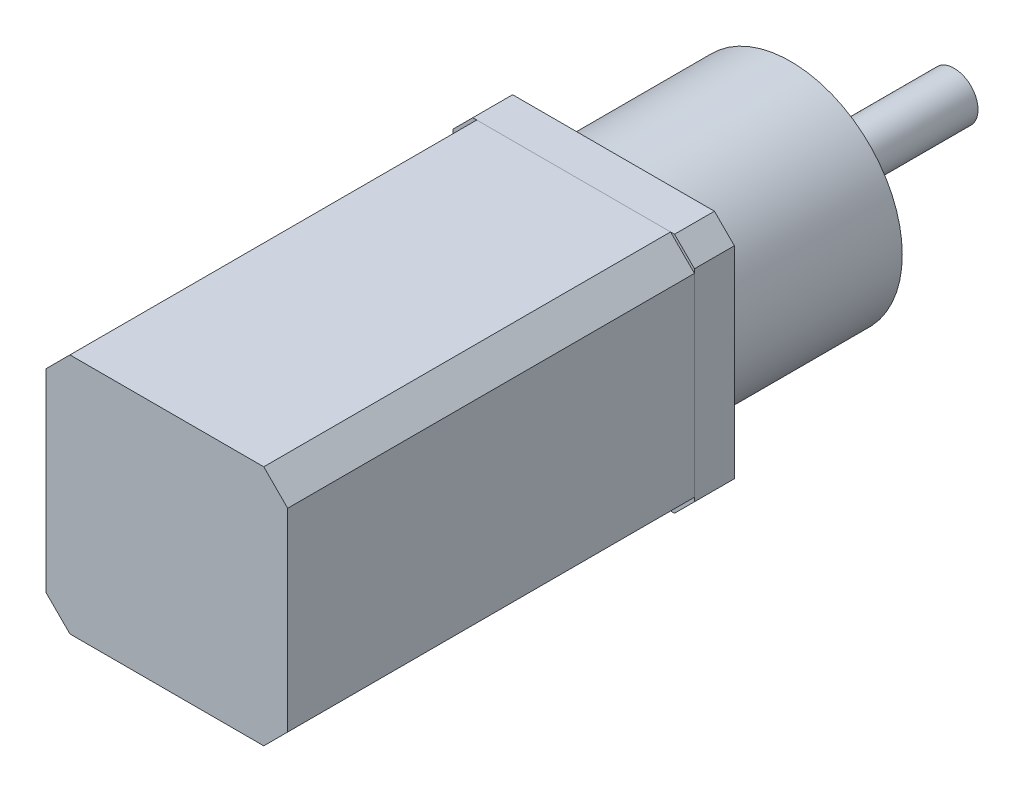
ISO-10303-21;
HEADER;
FILE_DESCRIPTION(('STEP AP214'),'2;1');
FILE_NAME('part.step','',(''),(''),'','','');
FILE_SCHEMA(('AUTOMOTIVE_DESIGN { 1 0 10303 214 1 1 1 1 }'));
ENDSEC;
DATA;
#1=APPLICATION_CONTEXT('core data for automotive mechanical design processes');
#2=APPLICATION_PROTOCOL_DEFINITION('international standard','automotive_design',2000,#1);
#3=PRODUCT_CONTEXT('',#1,'mechanical');
#4=PRODUCT('Part','Part','',(#3));
#5=PRODUCT_RELATED_PRODUCT_CATEGORY('part','',(#4));
#6=PRODUCT_DEFINITION_FORMATION('','',#4);
#7=PRODUCT_DEFINITION_CONTEXT('part definition',#1,'design');
#8=PRODUCT_DEFINITION('design','',#6,#7);
#9=PRODUCT_DEFINITION_SHAPE('','',#8);
#10=(LENGTH_UNIT() NAMED_UNIT(*) SI_UNIT(.MILLI.,.METRE.));
#11=(NAMED_UNIT(*) PLANE_ANGLE_UNIT() SI_UNIT($,.RADIAN.));
#12=(NAMED_UNIT(*) SI_UNIT($,.STERADIAN.) SOLID_ANGLE_UNIT());
#13=UNCERTAINTY_MEASURE_WITH_UNIT(LENGTH_MEASURE(1.E-05),#10,'distance_accuracy_value','');
#14=(GEOMETRIC_REPRESENTATION_CONTEXT(3) GLOBAL_UNCERTAINTY_ASSIGNED_CONTEXT((#13)) GLOBAL_UNIT_ASSIGNED_CONTEXT((#10,
#11,#12)) REPRESENTATION_CONTEXT('',''));
#15=CARTESIAN_POINT('',(0.,0.,0.));
#16=DIRECTION('',(0.,0.,1.));
#17=DIRECTION('',(1.,0.,0.));
#18=AXIS2_PLACEMENT_3D('',#15,#16,#17);
#19=CARTESIAN_POINT('',(-15.15,-15.15,-5.));
#20=DIRECTION('',(1.,0.,0.));
#21=DIRECTION('',(0.,0.,-1.));
#22=AXIS2_PLACEMENT_3D('',#19,#20,#21);
#23=PLANE('',#22);
#24=DIRECTION('',(0.,1.,0.));
#25=VECTOR('',#24,1.);
#26=CARTESIAN_POINT('',(-15.15,-15.15,-5.));
#27=LINE('',#26,#25);
#28=CARTESIAN_POINT('',(-15.15,-12.65,-5.));
#29=VERTEX_POINT('',#28);
#30=CARTESIAN_POINT('',(-15.15,12.65,-5.));
#31=VERTEX_POINT('',#30);
#32=EDGE_CURVE('E141',#29,#31,#27,.T.);
#33=ORIENTED_EDGE('',*,*,#32,.F.);
#34=DIRECTION('',(0.,0.,1.));
#35=VECTOR('',#34,1.);
#36=CARTESIAN_POINT('',(-15.15,-12.65,-5.));
#37=LINE('',#36,#35);
#38=CARTESIAN_POINT('',(-15.15,-12.65,0.));
#39=VERTEX_POINT('',#38);
#40=EDGE_CURVE('E12',#29,#39,#37,.T.);
#41=ORIENTED_EDGE('',*,*,#40,.T.);
#42=DIRECTION('',(0.,1.,0.));
#43=VECTOR('',#42,1.);
#44=CARTESIAN_POINT('',(-15.15,-15.15,0.));
#45=LINE('',#44,#43);
#46=CARTESIAN_POINT('',(-15.15,12.65,0.));
#47=VERTEX_POINT('',#46);
#48=EDGE_CURVE('E143',#39,#47,#45,.T.);
#49=ORIENTED_EDGE('',*,*,#48,.T.);
#50=DIRECTION('',(0.,0.,-1.));
#51=VECTOR('',#50,1.);
#52=CARTESIAN_POINT('',(-15.15,12.65,-5.));
#53=LINE('',#52,#51);
#54=EDGE_CURVE('E54',#47,#31,#53,.T.);
#55=ORIENTED_EDGE('',*,*,#54,.T.);
#56=EDGE_LOOP('',(#33,#41,#49,#55));
#57=FACE_BOUND('',#56,.T.);
#58=ADVANCED_FACE('F46',(#57),#23,.F.);
#59=CARTESIAN_POINT('',(15.15,15.15,-5.));
#60=DIRECTION('',(0.,-1.,0.));
#61=DIRECTION('',(0.,0.,-1.));
#62=AXIS2_PLACEMENT_3D('',#59,#60,#61);
#63=PLANE('',#62);
#64=DIRECTION('',(1.,0.,0.));
#65=VECTOR('',#64,1.);
#66=CARTESIAN_POINT('',(15.15,15.15,0.));
#67=LINE('',#66,#65);
#68=CARTESIAN_POINT('',(-12.65,15.15,0.));
#69=VERTEX_POINT('',#68);
#70=CARTESIAN_POINT('',(12.65,15.15,0.));
#71=VERTEX_POINT('',#70);
#72=EDGE_CURVE('E139',#69,#71,#67,.T.);
#73=ORIENTED_EDGE('',*,*,#72,.T.);
#74=DIRECTION('',(0.,0.,-1.));
#75=VECTOR('',#74,1.);
#76=CARTESIAN_POINT('',(12.65,15.15,-5.));
#77=LINE('',#76,#75);
#78=CARTESIAN_POINT('',(12.65,15.15,-5.));
#79=VERTEX_POINT('',#78);
#80=EDGE_CURVE('E118',#71,#79,#77,.T.);
#81=ORIENTED_EDGE('',*,*,#80,.T.);
#82=DIRECTION('',(1.,0.,0.));
#83=VECTOR('',#82,1.);
#84=CARTESIAN_POINT('',(15.15,15.15,-5.));
#85=LINE('',#84,#83);
#86=CARTESIAN_POINT('',(-12.65,15.15,-5.));
#87=VERTEX_POINT('',#86);
#88=EDGE_CURVE('E187',#87,#79,#85,.T.);
#89=ORIENTED_EDGE('',*,*,#88,.F.);
#90=DIRECTION('',(0.,0.,1.));
#91=VECTOR('',#90,1.);
#92=CARTESIAN_POINT('',(-12.65,15.15,-5.));
#93=LINE('',#92,#91);
#94=EDGE_CURVE('E123',#87,#69,#93,.T.);
#95=ORIENTED_EDGE('',*,*,#94,.T.);
#96=EDGE_LOOP('',(#73,#81,#89,#95));
#97=FACE_BOUND('',#96,.T.);
#98=ADVANCED_FACE('F191',(#97),#63,.F.);
#99=CARTESIAN_POINT('',(15.15,-15.15,-5.));
#100=DIRECTION('',(-1.,0.,0.));
#101=DIRECTION('',(0.,0.,1.));
#102=AXIS2_PLACEMENT_3D('',#99,#100,#101);
#103=PLANE('',#102);
#104=DIRECTION('',(0.,-1.,0.));
#105=VECTOR('',#104,1.);
#106=CARTESIAN_POINT('',(15.15,-15.15,-5.));
#107=LINE('',#106,#105);
#108=CARTESIAN_POINT('',(15.15,12.65,-5.));
#109=VERTEX_POINT('',#108);
#110=CARTESIAN_POINT('',(15.15,-12.65,-5.));
#111=VERTEX_POINT('',#110);
#112=EDGE_CURVE('E132',#109,#111,#107,.T.);
#113=ORIENTED_EDGE('',*,*,#112,.F.);
#114=DIRECTION('',(0.,0.,1.));
#115=VECTOR('',#114,1.);
#116=CARTESIAN_POINT('',(15.15,12.65,-5.));
#117=LINE('',#116,#115);
#118=CARTESIAN_POINT('',(15.15,12.65,0.));
#119=VERTEX_POINT('',#118);
#120=EDGE_CURVE('E117',#109,#119,#117,.T.);
#121=ORIENTED_EDGE('',*,*,#120,.T.);
#122=DIRECTION('',(0.,-1.,0.));
#123=VECTOR('',#122,1.);
#124=CARTESIAN_POINT('',(15.15,-15.15,0.));
#125=LINE('',#124,#123);
#126=CARTESIAN_POINT('',(15.15,-12.65,0.));
#127=VERTEX_POINT('',#126);
#128=EDGE_CURVE('E130',#119,#127,#125,.T.);
#129=ORIENTED_EDGE('',*,*,#128,.T.);
#130=DIRECTION('',(0.,0.,-1.));
#131=VECTOR('',#130,1.);
#132=CARTESIAN_POINT('',(15.15,-12.65,-5.));
#133=LINE('',#132,#131);
#134=EDGE_CURVE('E134',#127,#111,#133,.T.);
#135=ORIENTED_EDGE('',*,*,#134,.T.);
#136=EDGE_LOOP('',(#113,#121,#129,#135));
#137=FACE_BOUND('',#136,.T.);
#138=ADVANCED_FACE('F129',(#137),#103,.F.);
#139=CARTESIAN_POINT('',(15.15,-15.15,-5.));
#140=DIRECTION('',(0.,1.,0.));
#141=DIRECTION('',(0.,0.,1.));
#142=AXIS2_PLACEMENT_3D('',#139,#140,#141);
#143=PLANE('',#142);
#144=DIRECTION('',(-1.,0.,0.));
#145=VECTOR('',#144,1.);
#146=CARTESIAN_POINT('',(15.15,-15.15,-5.));
#147=LINE('',#146,#145);
#148=CARTESIAN_POINT('',(12.65,-15.15,-5.));
#149=VERTEX_POINT('',#148);
#150=CARTESIAN_POINT('',(-12.65,-15.15,-5.));
#151=VERTEX_POINT('',#150);
#152=EDGE_CURVE('E150',#149,#151,#147,.T.);
#153=ORIENTED_EDGE('',*,*,#152,.F.);
#154=DIRECTION('',(0.,0.,1.));
#155=VECTOR('',#154,1.);
#156=CARTESIAN_POINT('',(12.65,-15.15,-5.));
#157=LINE('',#156,#155);
#158=CARTESIAN_POINT('',(12.65,-15.15,0.));
#159=VERTEX_POINT('',#158);
#160=EDGE_CURVE('E172',#149,#159,#157,.T.);
#161=ORIENTED_EDGE('',*,*,#160,.T.);
#162=DIRECTION('',(-1.,0.,0.));
#163=VECTOR('',#162,1.);
#164=CARTESIAN_POINT('',(15.15,-15.15,0.));
#165=LINE('',#164,#163);
#166=CARTESIAN_POINT('',(-12.65,-15.15,0.));
#167=VERTEX_POINT('',#166);
#168=EDGE_CURVE('E138',#159,#167,#165,.T.);
#169=ORIENTED_EDGE('',*,*,#168,.T.);
#170=DIRECTION('',(0.,0.,-1.));
#171=VECTOR('',#170,1.);
#172=CARTESIAN_POINT('',(-12.65,-15.15,-5.));
#173=LINE('',#172,#171);
#174=EDGE_CURVE('E61',#167,#151,#173,.T.);
#175=ORIENTED_EDGE('',*,*,#174,.T.);
#176=EDGE_LOOP('',(#153,#161,#169,#175));
#177=FACE_BOUND('',#176,.T.);
#178=ADVANCED_FACE('F246',(#177),#143,.F.);
#179=CARTESIAN_POINT('',(0.,0.,-5.));
#180=DIRECTION('',(0.,0.,1.));
#181=DIRECTION('',(1.,0.,0.));
#182=AXIS2_PLACEMENT_3D('',#179,#180,#181);
#183=PLANE('',#182);
#184=CARTESIAN_POINT('',(0.,0.,-5.));
#185=DIRECTION('',(0.,0.,1.));
#186=DIRECTION('',(1.,0.,0.));
#187=AXIS2_PLACEMENT_3D('',#184,#185,#186);
#188=CIRCLE('',#187,14.);
#189=CARTESIAN_POINT('',(14.,0.,-5.));
#190=VERTEX_POINT('',#189);
#191=EDGE_CURVE('E147',#190,#190,#188,.F.);
#192=ORIENTED_EDGE('',*,*,#191,.F.);
#193=EDGE_LOOP('',(#192));
#194=FACE_BOUND('',#193,.T.);
#195=ORIENTED_EDGE('',*,*,#88,.T.);
#196=DIRECTION('',(-0.707106781186548,0.707106781186548,0.));
#197=VECTOR('',#196,1.);
#198=CARTESIAN_POINT('',(15.15,12.65,-5.));
#199=LINE('',#198,#197);
#200=EDGE_CURVE('E169',#79,#109,#199,.F.);
#201=ORIENTED_EDGE('',*,*,#200,.T.);
#202=ORIENTED_EDGE('',*,*,#112,.T.);
#203=DIRECTION('',(0.707106781186548,0.707106781186548,0.));
#204=VECTOR('',#203,1.);
#205=CARTESIAN_POINT('',(12.65,-15.15,-5.));
#206=LINE('',#205,#204);
#207=EDGE_CURVE('E68',#111,#149,#206,.F.);
#208=ORIENTED_EDGE('',*,*,#207,.T.);
#209=ORIENTED_EDGE('',*,*,#152,.T.);
#210=DIRECTION('',(0.707106781186548,-0.707106781186548,0.));
#211=VECTOR('',#210,1.);
#212=CARTESIAN_POINT('',(-15.15,-12.65,-5.));
#213=LINE('',#212,#211);
#214=EDGE_CURVE('E166',#151,#29,#213,.F.);
#215=ORIENTED_EDGE('',*,*,#214,.T.);
#216=ORIENTED_EDGE('',*,*,#32,.T.);
#217=DIRECTION('',(-0.707106781186548,-0.707106781186548,0.));
#218=VECTOR('',#217,1.);
#219=CARTESIAN_POINT('',(-12.65,15.15,-5.));
#220=LINE('',#219,#218);
#221=EDGE_CURVE('E164',#31,#87,#220,.F.);
#222=ORIENTED_EDGE('',*,*,#221,.T.);
#223=EDGE_LOOP('',(#195,#201,#202,#208,#209,#215,#216,#222));
#224=FACE_BOUND('',#223,.T.);
#225=ADVANCED_FACE('F184',(#194,#224),#183,.F.);
#226=CARTESIAN_POINT('',(0.,0.,0.));
#227=DIRECTION('',(0.,0.,1.));
#228=DIRECTION('',(1.,0.,0.));
#229=AXIS2_PLACEMENT_3D('',#226,#227,#228);
#230=PLANE('',#229);
#231=ORIENTED_EDGE('',*,*,#128,.F.);
#232=DIRECTION('',(0.707106781186548,-0.707106781186548,0.));
#233=VECTOR('',#232,1.);
#234=CARTESIAN_POINT('',(13.9,13.9,0.));
#235=LINE('',#234,#233);
#236=EDGE_CURVE('E113',#119,#71,#235,.F.);
#237=ORIENTED_EDGE('',*,*,#236,.T.);
#238=ORIENTED_EDGE('',*,*,#72,.F.);
#239=DIRECTION('',(0.707106781186548,0.707106781186548,0.));
#240=VECTOR('',#239,1.);
#241=CARTESIAN_POINT('',(-13.9,13.9,0.));
#242=LINE('',#241,#240);
#243=EDGE_CURVE('E133',#69,#47,#242,.F.);
#244=ORIENTED_EDGE('',*,*,#243,.T.);
#245=ORIENTED_EDGE('',*,*,#48,.F.);
#246=DIRECTION('',(-0.707106781186548,0.707106781186548,0.));
#247=VECTOR('',#246,1.);
#248=CARTESIAN_POINT('',(-13.9,-13.9,0.));
#249=LINE('',#248,#247);
#250=EDGE_CURVE('E158',#39,#167,#249,.F.);
#251=ORIENTED_EDGE('',*,*,#250,.T.);
#252=ORIENTED_EDGE('',*,*,#168,.F.);
#253=DIRECTION('',(-0.707106781186548,-0.707106781186548,0.));
#254=VECTOR('',#253,1.);
#255=CARTESIAN_POINT('',(13.9,-13.9,0.));
#256=LINE('',#255,#254);
#257=EDGE_CURVE('E124',#159,#127,#256,.F.);
#258=ORIENTED_EDGE('',*,*,#257,.T.);
#259=EDGE_LOOP('',(#231,#237,#238,#244,#245,#251,#252,#258));
#260=FACE_BOUND('',#259,.T.);
#261=ADVANCED_FACE('F136',(#260),#230,.T.);
#262=CARTESIAN_POINT('',(0.,0.,-27.2));
#263=DIRECTION('',(0.,0.,1.));
#264=DIRECTION('',(1.,0.,0.));
#265=AXIS2_PLACEMENT_3D('',#262,#263,#264);
#266=CYLINDRICAL_SURFACE('',#265,14.);
#267=CARTESIAN_POINT('',(0.,0.,-27.2));
#268=DIRECTION('',(0.,0.,-1.));
#269=DIRECTION('',(-1.,0.,0.));
#270=AXIS2_PLACEMENT_3D('',#267,#268,#269);
#271=CIRCLE('',#270,14.);
#272=CARTESIAN_POINT('',(-14.,0.,-27.2));
#273=VERTEX_POINT('',#272);
#274=EDGE_CURVE('E192',#273,#273,#271,.T.);
#275=ORIENTED_EDGE('',*,*,#274,.F.);
#276=EDGE_LOOP('',(#275));
#277=FACE_BOUND('',#276,.T.);
#278=ORIENTED_EDGE('',*,*,#191,.T.);
#279=EDGE_LOOP('',(#278));
#280=FACE_BOUND('',#279,.T.);
#281=ADVANCED_FACE('F236',(#277,#280),#266,.T.);
#282=CARTESIAN_POINT('',(0.,0.,-27.2));
#283=DIRECTION('',(0.,0.,-1.));
#284=DIRECTION('',(-1.,0.,0.));
#285=AXIS2_PLACEMENT_3D('',#282,#283,#284);
#286=PLANE('',#285);
#287=CARTESIAN_POINT('',(0.,0.,-27.2));
#288=DIRECTION('',(0.,0.,-1.));
#289=DIRECTION('',(-1.,0.,0.));
#290=AXIS2_PLACEMENT_3D('',#287,#288,#289);
#291=CIRCLE('',#290,9.);
#292=CARTESIAN_POINT('',(-9.,0.,-27.2));
#293=VERTEX_POINT('',#292);
#294=EDGE_CURVE('E200',#293,#293,#291,.T.);
#295=ORIENTED_EDGE('',*,*,#294,.F.);
#296=EDGE_LOOP('',(#295));
#297=FACE_BOUND('',#296,.T.);
#298=ORIENTED_EDGE('',*,*,#274,.T.);
#299=EDGE_LOOP('',(#298));
#300=FACE_BOUND('',#299,.T.);
#301=ADVANCED_FACE('F230',(#297,#300),#286,.T.);
#302=CARTESIAN_POINT('',(0.,0.,-29.2));
#303=DIRECTION('',(0.,0.,1.));
#304=DIRECTION('',(1.,0.,0.));
#305=AXIS2_PLACEMENT_3D('',#302,#303,#304);
#306=CYLINDRICAL_SURFACE('',#305,9.);
#307=CARTESIAN_POINT('',(0.,0.,-29.2));
#308=DIRECTION('',(0.,0.,-1.));
#309=DIRECTION('',(-1.,0.,0.));
#310=AXIS2_PLACEMENT_3D('',#307,#308,#309);
#311=CIRCLE('',#310,9.);
#312=CARTESIAN_POINT('',(-9.,0.,-29.2));
#313=VERTEX_POINT('',#312);
#314=EDGE_CURVE('E194',#313,#313,#311,.T.);
#315=ORIENTED_EDGE('',*,*,#314,.F.);
#316=EDGE_LOOP('',(#315));
#317=FACE_BOUND('',#316,.T.);
#318=ORIENTED_EDGE('',*,*,#294,.T.);
#319=EDGE_LOOP('',(#318));
#320=FACE_BOUND('',#319,.T.);
#321=ADVANCED_FACE('F224',(#317,#320),#306,.T.);
#322=CARTESIAN_POINT('',(0.,0.,-29.2));
#323=DIRECTION('',(0.,0.,-1.));
#324=DIRECTION('',(-1.,0.,0.));
#325=AXIS2_PLACEMENT_3D('',#322,#323,#324);
#326=PLANE('',#325);
#327=CARTESIAN_POINT('',(0.,0.,-29.2));
#328=DIRECTION('',(0.,0.,-1.));
#329=DIRECTION('',(-1.,0.,0.));
#330=AXIS2_PLACEMENT_3D('',#327,#328,#329);
#331=CIRCLE('',#330,4.32234312039916);
#332=CARTESIAN_POINT('',(-4.32234312039916,0.,-29.2));
#333=VERTEX_POINT('',#332);
#334=EDGE_CURVE('E207',#333,#333,#331,.T.);
#335=ORIENTED_EDGE('',*,*,#334,.F.);
#336=EDGE_LOOP('',(#335));
#337=FACE_BOUND('',#336,.T.);
#338=ORIENTED_EDGE('',*,*,#314,.T.);
#339=EDGE_LOOP('',(#338));
#340=FACE_BOUND('',#339,.T.);
#341=ADVANCED_FACE('F218',(#337,#340),#326,.T.);
#342=CARTESIAN_POINT('',(0.,0.,-29.6));
#343=DIRECTION('',(0.,0.,1.));
#344=DIRECTION('',(1.,0.,0.));
#345=AXIS2_PLACEMENT_3D('',#342,#343,#344);
#346=CYLINDRICAL_SURFACE('',#345,4.32234312039916);
#347=CARTESIAN_POINT('',(0.,0.,-29.6));
#348=DIRECTION('',(0.,0.,-1.));
#349=DIRECTION('',(-1.,0.,0.));
#350=AXIS2_PLACEMENT_3D('',#347,#348,#349);
#351=CIRCLE('',#350,4.32234312039916);
#352=CARTESIAN_POINT('',(-4.32234312039916,0.,-29.6));
#353=VERTEX_POINT('',#352);
#354=EDGE_CURVE('E155',#353,#353,#351,.T.);
#355=ORIENTED_EDGE('',*,*,#354,.F.);
#356=EDGE_LOOP('',(#355));
#357=FACE_BOUND('',#356,.T.);
#358=ORIENTED_EDGE('',*,*,#334,.T.);
#359=EDGE_LOOP('',(#358));
#360=FACE_BOUND('',#359,.T.);
#361=ADVANCED_FACE('F215',(#357,#360),#346,.T.);
#362=CARTESIAN_POINT('',(0.,0.,-29.6));
#363=DIRECTION('',(0.,0.,-1.));
#364=DIRECTION('',(-1.,0.,0.));
#365=AXIS2_PLACEMENT_3D('',#362,#363,#364);
#366=PLANE('',#365);
#367=CARTESIAN_POINT('',(0.,0.,-29.6));
#368=DIRECTION('',(0.,0.,-1.));
#369=DIRECTION('',(-1.,0.,0.));
#370=AXIS2_PLACEMENT_3D('',#367,#368,#369);
#371=CIRCLE('',#370,3.);
#372=CARTESIAN_POINT('',(-3.,0.,-29.6));
#373=VERTEX_POINT('',#372);
#374=EDGE_CURVE('E151',#373,#373,#371,.T.);
#375=ORIENTED_EDGE('',*,*,#374,.F.);
#376=EDGE_LOOP('',(#375));
#377=FACE_BOUND('',#376,.T.);
#378=ORIENTED_EDGE('',*,*,#354,.T.);
#379=EDGE_LOOP('',(#378));
#380=FACE_BOUND('',#379,.T.);
#381=ADVANCED_FACE('F213',(#377,#380),#366,.T.);
#382=CARTESIAN_POINT('',(0.,0.,-47.7));
#383=DIRECTION('',(0.,0.,-1.));
#384=DIRECTION('',(-1.,0.,0.));
#385=AXIS2_PLACEMENT_3D('',#382,#383,#384);
#386=PLANE('',#385);
#387=CARTESIAN_POINT('',(0.,0.,-47.7));
#388=DIRECTION('',(0.,0.,-1.));
#389=DIRECTION('',(-1.,0.,0.));
#390=AXIS2_PLACEMENT_3D('',#387,#388,#389);
#391=CIRCLE('',#390,3.);
#392=CARTESIAN_POINT('',(-3.,0.,-47.7));
#393=VERTEX_POINT('',#392);
#394=EDGE_CURVE('E154',#393,#393,#391,.T.);
#395=ORIENTED_EDGE('',*,*,#394,.T.);
#396=EDGE_LOOP('',(#395));
#397=FACE_BOUND('',#396,.T.);
#398=ADVANCED_FACE('F336',(#397),#386,.T.);
#399=CARTESIAN_POINT('',(0.,0.,-47.7));
#400=DIRECTION('',(0.,0.,1.));
#401=DIRECTION('',(1.,0.,0.));
#402=AXIS2_PLACEMENT_3D('',#399,#400,#401);
#403=CYLINDRICAL_SURFACE('',#402,3.);
#404=ORIENTED_EDGE('',*,*,#374,.T.);
#405=EDGE_LOOP('',(#404));
#406=FACE_BOUND('',#405,.T.);
#407=ORIENTED_EDGE('',*,*,#394,.F.);
#408=EDGE_LOOP('',(#407));
#409=FACE_BOUND('',#408,.T.);
#410=ADVANCED_FACE('F265',(#406,#409),#403,.T.);
#411=CARTESIAN_POINT('',(15.15,12.65,-5.));
#412=DIRECTION('',(-0.707106781186547,-0.707106781186547,0.));
#413=DIRECTION('',(0.,0.,1.));
#414=AXIS2_PLACEMENT_3D('',#411,#412,#413);
#415=PLANE('',#414);
#416=ORIENTED_EDGE('',*,*,#200,.F.);
#417=ORIENTED_EDGE('',*,*,#80,.F.);
#418=ORIENTED_EDGE('',*,*,#236,.F.);
#419=ORIENTED_EDGE('',*,*,#120,.F.);
#420=EDGE_LOOP('',(#416,#417,#418,#419));
#421=FACE_BOUND('',#420,.T.);
#422=ADVANCED_FACE('F116',(#421),#415,.F.);
#423=CARTESIAN_POINT('',(12.65,-15.15,-5.));
#424=DIRECTION('',(-0.707106781186547,0.707106781186547,0.));
#425=DIRECTION('',(0.,0.,1.));
#426=AXIS2_PLACEMENT_3D('',#423,#424,#425);
#427=PLANE('',#426);
#428=ORIENTED_EDGE('',*,*,#207,.F.);
#429=ORIENTED_EDGE('',*,*,#134,.F.);
#430=ORIENTED_EDGE('',*,*,#257,.F.);
#431=ORIENTED_EDGE('',*,*,#160,.F.);
#432=EDGE_LOOP('',(#428,#429,#430,#431));
#433=FACE_BOUND('',#432,.T.);
#434=ADVANCED_FACE('F264',(#433),#427,.F.);
#435=CARTESIAN_POINT('',(-15.15,-12.65,-5.));
#436=DIRECTION('',(0.707106781186547,0.707106781186547,0.));
#437=DIRECTION('',(0.,0.,1.));
#438=AXIS2_PLACEMENT_3D('',#435,#436,#437);
#439=PLANE('',#438);
#440=ORIENTED_EDGE('',*,*,#214,.F.);
#441=ORIENTED_EDGE('',*,*,#174,.F.);
#442=ORIENTED_EDGE('',*,*,#250,.F.);
#443=ORIENTED_EDGE('',*,*,#40,.F.);
#444=EDGE_LOOP('',(#440,#441,#442,#443));
#445=FACE_BOUND('',#444,.T.);
#446=ADVANCED_FACE('F267',(#445),#439,.F.);
#447=CARTESIAN_POINT('',(-12.65,15.15,-5.));
#448=DIRECTION('',(0.707106781186547,-0.707106781186547,0.));
#449=DIRECTION('',(0.,0.,1.));
#450=AXIS2_PLACEMENT_3D('',#447,#448,#449);
#451=PLANE('',#450);
#452=ORIENTED_EDGE('',*,*,#221,.F.);
#453=ORIENTED_EDGE('',*,*,#54,.F.);
#454=ORIENTED_EDGE('',*,*,#243,.F.);
#455=ORIENTED_EDGE('',*,*,#94,.F.);
#456=EDGE_LOOP('',(#452,#453,#454,#455));
#457=FACE_BOUND('',#456,.T.);
#458=ADVANCED_FACE('F48',(#457),#451,.F.);
#459=CLOSED_SHELL('',(#58,#98,#138,#178,#225,#261,#281,#301,#321,#341,#361,#381,#398,#410,#422,
#434,#446,#458));
#460=MANIFOLD_SOLID_BREP('B2',#459);
#461=CARTESIAN_POINT('',(15.15,15.15,51.));
#462=DIRECTION('',(-1.,0.,0.));
#463=DIRECTION('',(0.,-1.,0.));
#464=AXIS2_PLACEMENT_3D('',#461,#462,#463);
#465=PLANE('',#464);
#466=DIRECTION('',(0.,1.,0.));
#467=VECTOR('',#466,1.);
#468=CARTESIAN_POINT('',(15.15,15.15,51.));
#469=LINE('',#468,#467);
#470=CARTESIAN_POINT('',(15.15,-12.15,51.));
#471=VERTEX_POINT('',#470);
#472=CARTESIAN_POINT('',(15.15,12.15,51.));
#473=VERTEX_POINT('',#472);
#474=EDGE_CURVE('E486',#471,#473,#469,.T.);
#475=ORIENTED_EDGE('',*,*,#474,.F.);
#476=DIRECTION('',(0.,0.,-1.));
#477=VECTOR('',#476,1.);
#478=CARTESIAN_POINT('',(15.15,-12.15,51.));
#479=LINE('',#478,#477);
#480=CARTESIAN_POINT('',(15.15,-12.15,0.));
#481=VERTEX_POINT('',#480);
#482=EDGE_CURVE('E512',#471,#481,#479,.T.);
#483=ORIENTED_EDGE('',*,*,#482,.T.);
#484=DIRECTION('',(0.,1.,0.));
#485=VECTOR('',#484,1.);
#486=CARTESIAN_POINT('',(15.15,15.15,0.));
#487=LINE('',#486,#485);
#488=CARTESIAN_POINT('',(15.15,12.15,0.));
#489=VERTEX_POINT('',#488);
#490=EDGE_CURVE('E520',#481,#489,#487,.T.);
#491=ORIENTED_EDGE('',*,*,#490,.T.);
#492=DIRECTION('',(0.,0.,1.));
#493=VECTOR('',#492,1.);
#494=CARTESIAN_POINT('',(15.15,12.15,51.));
#495=LINE('',#494,#493);
#496=EDGE_CURVE('E510',#489,#473,#495,.T.);
#497=ORIENTED_EDGE('',*,*,#496,.T.);
#498=EDGE_LOOP('',(#475,#483,#491,#497));
#499=FACE_BOUND('',#498,.T.);
#500=ADVANCED_FACE('F395',(#499),#465,.F.);
#501=CARTESIAN_POINT('',(-15.15,15.15,51.));
#502=DIRECTION('',(0.,-1.,0.));
#503=DIRECTION('',(0.,0.,-1.));
#504=AXIS2_PLACEMENT_3D('',#501,#502,#503);
#505=PLANE('',#504);
#506=DIRECTION('',(-1.,0.,0.));
#507=VECTOR('',#506,1.);
#508=CARTESIAN_POINT('',(-15.15,15.15,0.));
#509=LINE('',#508,#507);
#510=CARTESIAN_POINT('',(12.15,15.15,0.));
#511=VERTEX_POINT('',#510);
#512=CARTESIAN_POINT('',(-12.15,15.15,0.));
#513=VERTEX_POINT('',#512);
#514=EDGE_CURVE('E491',#511,#513,#509,.T.);
#515=ORIENTED_EDGE('',*,*,#514,.T.);
#516=DIRECTION('',(0.,0.,1.));
#517=VECTOR('',#516,1.);
#518=CARTESIAN_POINT('',(-12.15,15.15,51.));
#519=LINE('',#518,#517);
#520=CARTESIAN_POINT('',(-12.15,15.15,51.));
#521=VERTEX_POINT('',#520);
#522=EDGE_CURVE('E44',#513,#521,#519,.T.);
#523=ORIENTED_EDGE('',*,*,#522,.T.);
#524=DIRECTION('',(-1.,0.,0.));
#525=VECTOR('',#524,1.);
#526=CARTESIAN_POINT('',(-15.15,15.15,51.));
#527=LINE('',#526,#525);
#528=CARTESIAN_POINT('',(12.15,15.15,51.));
#529=VERTEX_POINT('',#528);
#530=EDGE_CURVE('E489',#529,#521,#527,.T.);
#531=ORIENTED_EDGE('',*,*,#530,.F.);
#532=DIRECTION('',(0.,0.,-1.));
#533=VECTOR('',#532,1.);
#534=CARTESIAN_POINT('',(12.15,15.15,51.));
#535=LINE('',#534,#533);
#536=EDGE_CURVE('E403',#529,#511,#535,.T.);
#537=ORIENTED_EDGE('',*,*,#536,.T.);
#538=EDGE_LOOP('',(#515,#523,#531,#537));
#539=FACE_BOUND('',#538,.T.);
#540=ADVANCED_FACE('F517',(#539),#505,.F.);
#541=CARTESIAN_POINT('',(-15.15,15.15,51.));
#542=DIRECTION('',(1.,0.,0.));
#543=DIRECTION('',(0.,1.,0.));
#544=AXIS2_PLACEMENT_3D('',#541,#542,#543);
#545=PLANE('',#544);
#546=DIRECTION('',(0.,-1.,0.));
#547=VECTOR('',#546,1.);
#548=CARTESIAN_POINT('',(-15.15,15.15,0.));
#549=LINE('',#548,#547);
#550=CARTESIAN_POINT('',(-15.15,12.15,0.));
#551=VERTEX_POINT('',#550);
#552=CARTESIAN_POINT('',(-15.15,-12.15,0.));
#553=VERTEX_POINT('',#552);
#554=EDGE_CURVE('E487',#551,#553,#549,.T.);
#555=ORIENTED_EDGE('',*,*,#554,.T.);
#556=DIRECTION('',(0.,0.,1.));
#557=VECTOR('',#556,1.);
#558=CARTESIAN_POINT('',(-15.15,-12.15,51.));
#559=LINE('',#558,#557);
#560=CARTESIAN_POINT('',(-15.15,-12.15,51.));
#561=VERTEX_POINT('',#560);
#562=EDGE_CURVE('E465',#553,#561,#559,.T.);
#563=ORIENTED_EDGE('',*,*,#562,.T.);
#564=DIRECTION('',(0.,-1.,0.));
#565=VECTOR('',#564,1.);
#566=CARTESIAN_POINT('',(-15.15,15.15,51.));
#567=LINE('',#566,#565);
#568=CARTESIAN_POINT('',(-15.15,12.15,51.));
#569=VERTEX_POINT('',#568);
#570=EDGE_CURVE('E524',#569,#561,#567,.T.);
#571=ORIENTED_EDGE('',*,*,#570,.F.);
#572=DIRECTION('',(0.,0.,-1.));
#573=VECTOR('',#572,1.);
#574=CARTESIAN_POINT('',(-15.15,12.15,51.));
#575=LINE('',#574,#573);
#576=EDGE_CURVE('E470',#569,#551,#575,.T.);
#577=ORIENTED_EDGE('',*,*,#576,.T.);
#578=EDGE_LOOP('',(#555,#563,#571,#577));
#579=FACE_BOUND('',#578,.T.);
#580=ADVANCED_FACE('F534',(#579),#545,.F.);
#581=CARTESIAN_POINT('',(-15.15,-15.15,51.));
#582=DIRECTION('',(0.,1.,0.));
#583=DIRECTION('',(0.,0.,1.));
#584=AXIS2_PLACEMENT_3D('',#581,#582,#583);
#585=PLANE('',#584);
#586=DIRECTION('',(1.,0.,0.));
#587=VECTOR('',#586,1.);
#588=CARTESIAN_POINT('',(-15.15,-15.15,51.));
#589=LINE('',#588,#587);
#590=CARTESIAN_POINT('',(-12.15,-15.15,51.));
#591=VERTEX_POINT('',#590);
#592=CARTESIAN_POINT('',(12.15,-15.15,51.));
#593=VERTEX_POINT('',#592);
#594=EDGE_CURVE('E480',#591,#593,#589,.T.);
#595=ORIENTED_EDGE('',*,*,#594,.F.);
#596=DIRECTION('',(0.,0.,-1.));
#597=VECTOR('',#596,1.);
#598=CARTESIAN_POINT('',(-12.15,-15.15,51.));
#599=LINE('',#598,#597);
#600=CARTESIAN_POINT('',(-12.15,-15.15,0.));
#601=VERTEX_POINT('',#600);
#602=EDGE_CURVE('E464',#591,#601,#599,.T.);
#603=ORIENTED_EDGE('',*,*,#602,.T.);
#604=DIRECTION('',(1.,0.,0.));
#605=VECTOR('',#604,1.);
#606=CARTESIAN_POINT('',(-15.15,-15.15,0.));
#607=LINE('',#606,#605);
#608=CARTESIAN_POINT('',(12.15,-15.15,0.));
#609=VERTEX_POINT('',#608);
#610=EDGE_CURVE('E477',#601,#609,#607,.T.);
#611=ORIENTED_EDGE('',*,*,#610,.T.);
#612=DIRECTION('',(0.,0.,1.));
#613=VECTOR('',#612,1.);
#614=CARTESIAN_POINT('',(12.15,-15.15,51.));
#615=LINE('',#614,#613);
#616=EDGE_CURVE('E482',#609,#593,#615,.T.);
#617=ORIENTED_EDGE('',*,*,#616,.T.);
#618=EDGE_LOOP('',(#595,#603,#611,#617));
#619=FACE_BOUND('',#618,.T.);
#620=ADVANCED_FACE('F476',(#619),#585,.F.);
#621=CARTESIAN_POINT('',(0.,0.,51.));
#622=DIRECTION('',(0.,0.,1.));
#623=DIRECTION('',(1.,0.,0.));
#624=AXIS2_PLACEMENT_3D('',#621,#622,#623);
#625=PLANE('',#624);
#626=ORIENTED_EDGE('',*,*,#570,.T.);
#627=DIRECTION('',(-0.707106781186547,0.707106781186548,0.));
#628=VECTOR('',#627,1.);
#629=CARTESIAN_POINT('',(-13.65,-13.65,51.));
#630=LINE('',#629,#628);
#631=EDGE_CURVE('E508',#561,#591,#630,.F.);
#632=ORIENTED_EDGE('',*,*,#631,.T.);
#633=ORIENTED_EDGE('',*,*,#594,.T.);
#634=DIRECTION('',(-0.707106781186548,-0.707106781186547,0.));
#635=VECTOR('',#634,1.);
#636=CARTESIAN_POINT('',(13.65,-13.65,51.));
#637=LINE('',#636,#635);
#638=EDGE_CURVE('E506',#593,#471,#637,.F.);
#639=ORIENTED_EDGE('',*,*,#638,.T.);
#640=ORIENTED_EDGE('',*,*,#474,.T.);
#641=DIRECTION('',(0.707106781186547,-0.707106781186548,0.));
#642=VECTOR('',#641,1.);
#643=CARTESIAN_POINT('',(13.65,13.65,51.));
#644=LINE('',#643,#642);
#645=EDGE_CURVE('E415',#473,#529,#644,.F.);
#646=ORIENTED_EDGE('',*,*,#645,.T.);
#647=ORIENTED_EDGE('',*,*,#530,.T.);
#648=DIRECTION('',(0.707106781186548,0.707106781186547,0.));
#649=VECTOR('',#648,1.);
#650=CARTESIAN_POINT('',(-13.65,13.65,51.));
#651=LINE('',#650,#649);
#652=EDGE_CURVE('E504',#521,#569,#651,.F.);
#653=ORIENTED_EDGE('',*,*,#652,.T.);
#654=EDGE_LOOP('',(#626,#632,#633,#639,#640,#646,#647,#653));
#655=FACE_BOUND('',#654,.T.);
#656=ADVANCED_FACE('F528',(#655),#625,.T.);
#657=CARTESIAN_POINT('',(0.,0.,0.));
#658=DIRECTION('',(0.,0.,1.));
#659=DIRECTION('',(1.,0.,0.));
#660=AXIS2_PLACEMENT_3D('',#657,#658,#659);
#661=PLANE('',#660);
#662=ORIENTED_EDGE('',*,*,#610,.F.);
#663=DIRECTION('',(0.707106781186547,-0.707106781186548,0.));
#664=VECTOR('',#663,1.);
#665=CARTESIAN_POINT('',(-12.15,-15.15,0.));
#666=LINE('',#665,#664);
#667=EDGE_CURVE('E460',#601,#553,#666,.F.);
#668=ORIENTED_EDGE('',*,*,#667,.T.);
#669=ORIENTED_EDGE('',*,*,#554,.F.);
#670=DIRECTION('',(-0.707106781186548,-0.707106781186547,0.));
#671=VECTOR('',#670,1.);
#672=CARTESIAN_POINT('',(-15.15,12.15,0.));
#673=LINE('',#672,#671);
#674=EDGE_CURVE('E497',#551,#513,#673,.F.);
#675=ORIENTED_EDGE('',*,*,#674,.T.);
#676=ORIENTED_EDGE('',*,*,#514,.F.);
#677=DIRECTION('',(-0.707106781186547,0.707106781186548,0.));
#678=VECTOR('',#677,1.);
#679=CARTESIAN_POINT('',(12.15,15.15,0.));
#680=LINE('',#679,#678);
#681=EDGE_CURVE('E481',#511,#489,#680,.F.);
#682=ORIENTED_EDGE('',*,*,#681,.T.);
#683=ORIENTED_EDGE('',*,*,#490,.F.);
#684=DIRECTION('',(0.707106781186548,0.707106781186547,0.));
#685=VECTOR('',#684,1.);
#686=CARTESIAN_POINT('',(15.15,-12.15,0.));
#687=LINE('',#686,#685);
#688=EDGE_CURVE('E471',#481,#609,#687,.F.);
#689=ORIENTED_EDGE('',*,*,#688,.T.);
#690=EDGE_LOOP('',(#662,#668,#669,#675,#676,#682,#683,#689));
#691=FACE_BOUND('',#690,.T.);
#692=ADVANCED_FACE('F484',(#691),#661,.F.);
#693=CARTESIAN_POINT('',(-12.15,-15.15,51.));
#694=DIRECTION('',(0.707106781186548,0.707106781186547,0.));
#695=DIRECTION('',(0.,0.,-1.));
#696=AXIS2_PLACEMENT_3D('',#693,#694,#695);
#697=PLANE('',#696);
#698=ORIENTED_EDGE('',*,*,#631,.F.);
#699=ORIENTED_EDGE('',*,*,#562,.F.);
#700=ORIENTED_EDGE('',*,*,#667,.F.);
#701=ORIENTED_EDGE('',*,*,#602,.F.);
#702=EDGE_LOOP('',(#698,#699,#700,#701));
#703=FACE_BOUND('',#702,.T.);
#704=ADVANCED_FACE('F463',(#703),#697,.F.);
#705=CARTESIAN_POINT('',(15.15,-12.15,51.));
#706=DIRECTION('',(-0.707106781186547,0.707106781186548,0.));
#707=DIRECTION('',(0.,0.,-1.));
#708=AXIS2_PLACEMENT_3D('',#705,#706,#707);
#709=PLANE('',#708);
#710=ORIENTED_EDGE('',*,*,#638,.F.);
#711=ORIENTED_EDGE('',*,*,#616,.F.);
#712=ORIENTED_EDGE('',*,*,#688,.F.);
#713=ORIENTED_EDGE('',*,*,#482,.F.);
#714=EDGE_LOOP('',(#710,#711,#712,#713));
#715=FACE_BOUND('',#714,.T.);
#716=ADVANCED_FACE('F539',(#715),#709,.F.);
#717=CARTESIAN_POINT('',(-15.15,12.15,51.));
#718=DIRECTION('',(0.707106781186547,-0.707106781186548,0.));
#719=DIRECTION('',(0.,0.,-1.));
#720=AXIS2_PLACEMENT_3D('',#717,#718,#719);
#721=PLANE('',#720);
#722=ORIENTED_EDGE('',*,*,#652,.F.);
#723=ORIENTED_EDGE('',*,*,#522,.F.);
#724=ORIENTED_EDGE('',*,*,#674,.F.);
#725=ORIENTED_EDGE('',*,*,#576,.F.);
#726=EDGE_LOOP('',(#722,#723,#724,#725));
#727=FACE_BOUND('',#726,.T.);
#728=ADVANCED_FACE('F532',(#727),#721,.F.);
#729=CARTESIAN_POINT('',(12.15,15.15,51.));
#730=DIRECTION('',(-0.707106781186548,-0.707106781186547,0.));
#731=DIRECTION('',(0.,0.,-1.));
#732=AXIS2_PLACEMENT_3D('',#729,#730,#731);
#733=PLANE('',#732);
#734=ORIENTED_EDGE('',*,*,#645,.F.);
#735=ORIENTED_EDGE('',*,*,#496,.F.);
#736=ORIENTED_EDGE('',*,*,#681,.F.);
#737=ORIENTED_EDGE('',*,*,#536,.F.);
#738=EDGE_LOOP('',(#734,#735,#736,#737));
#739=FACE_BOUND('',#738,.T.);
#740=ADVANCED_FACE('F397',(#739),#733,.F.);
#741=CLOSED_SHELL('',(#500,#540,#580,#620,#656,#692,#704,#716,#728,#740));
#742=MANIFOLD_SOLID_BREP('B6',#741);
#743=ADVANCED_BREP_SHAPE_REPRESENTATION('',(#18,#460,#742),#14);
#744=SHAPE_DEFINITION_REPRESENTATION(#9,#743);
ENDSEC;
END-ISO-10303-21;
